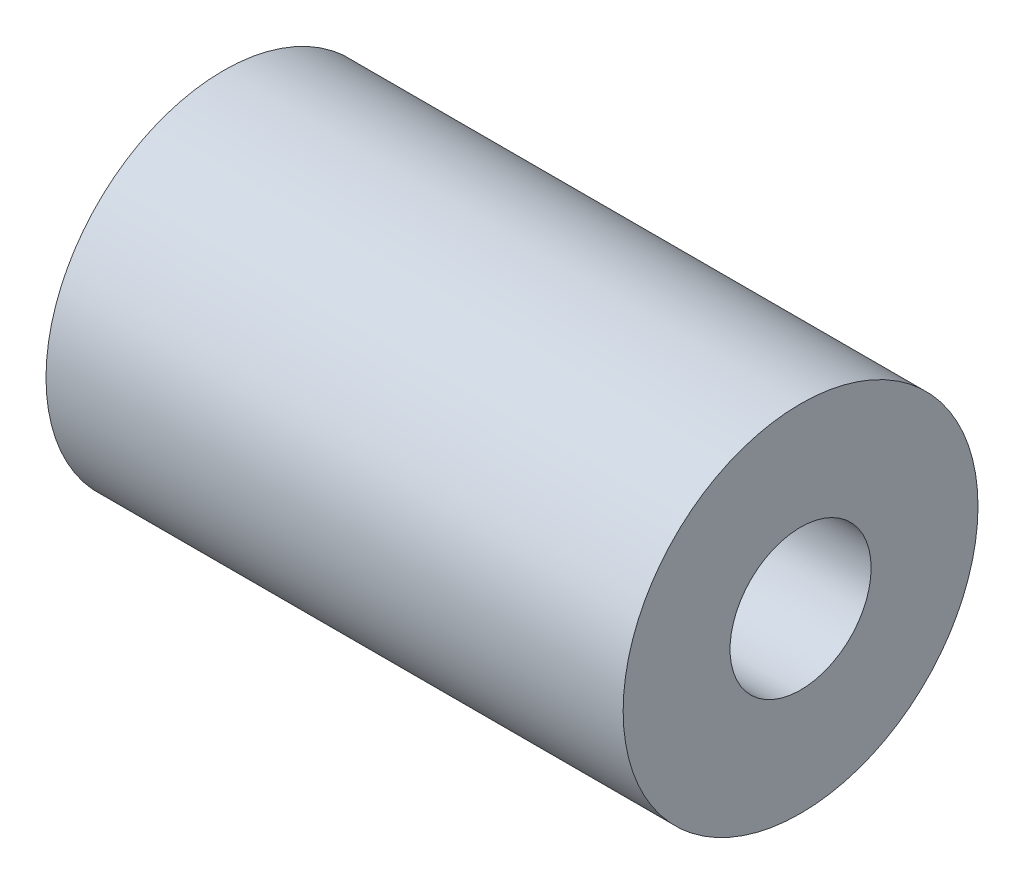
ISO-10303-21;
HEADER;
FILE_DESCRIPTION(('STEP AP214'),'2;1');
FILE_NAME('part.step','',(''),(''),'','','');
FILE_SCHEMA(('AUTOMOTIVE_DESIGN { 1 0 10303 214 1 1 1 1 }'));
ENDSEC;
DATA;
#1=APPLICATION_CONTEXT('core data for automotive mechanical design processes');
#2=APPLICATION_PROTOCOL_DEFINITION('international standard','automotive_design',2000,#1);
#3=PRODUCT_CONTEXT('',#1,'mechanical');
#4=PRODUCT('Part','Part','',(#3));
#5=PRODUCT_RELATED_PRODUCT_CATEGORY('part','',(#4));
#6=PRODUCT_DEFINITION_FORMATION('','',#4);
#7=PRODUCT_DEFINITION_CONTEXT('part definition',#1,'design');
#8=PRODUCT_DEFINITION('design','',#6,#7);
#9=PRODUCT_DEFINITION_SHAPE('','',#8);
#10=(LENGTH_UNIT() NAMED_UNIT(*) SI_UNIT(.MILLI.,.METRE.));
#11=(NAMED_UNIT(*) PLANE_ANGLE_UNIT() SI_UNIT($,.RADIAN.));
#12=(NAMED_UNIT(*) SI_UNIT($,.STERADIAN.) SOLID_ANGLE_UNIT());
#13=UNCERTAINTY_MEASURE_WITH_UNIT(LENGTH_MEASURE(1.E-05),#10,'distance_accuracy_value','');
#14=(GEOMETRIC_REPRESENTATION_CONTEXT(3) GLOBAL_UNCERTAINTY_ASSIGNED_CONTEXT((#13)) GLOBAL_UNIT_ASSIGNED_CONTEXT((#10,
#11,#12)) REPRESENTATION_CONTEXT('',''));
#15=CARTESIAN_POINT('',(0.,0.,0.));
#16=DIRECTION('',(0.,0.,1.));
#17=DIRECTION('',(1.,0.,0.));
#18=AXIS2_PLACEMENT_3D('',#15,#16,#17);
#19=CARTESIAN_POINT('',(13.5,0.,0.));
#20=DIRECTION('',(1.,0.,0.));
#21=DIRECTION('',(0.,0.,-1.));
#22=AXIS2_PLACEMENT_3D('',#19,#20,#21);
#23=PLANE('',#22);
#24=CARTESIAN_POINT('',(13.5,0.,0.));
#25=DIRECTION('',(1.,0.,0.));
#26=DIRECTION('',(0.,0.,-1.));
#27=AXIS2_PLACEMENT_3D('',#24,#25,#26);
#28=CIRCLE('',#27,4.15);
#29=CARTESIAN_POINT('',(13.5,0.,-4.15));
#30=VERTEX_POINT('',#29);
#31=EDGE_CURVE('E10',#30,#30,#28,.T.);
#32=ORIENTED_EDGE('',*,*,#31,.T.);
#33=EDGE_LOOP('',(#32));
#34=FACE_BOUND('',#33,.T.);
#35=CARTESIAN_POINT('',(13.5,0.,0.));
#36=DIRECTION('',(1.,0.,0.));
#37=DIRECTION('',(0.,0.,-1.));
#38=AXIS2_PLACEMENT_3D('',#35,#36,#37);
#39=CIRCLE('',#38,1.65);
#40=CARTESIAN_POINT('',(13.5,0.,-1.65));
#41=VERTEX_POINT('',#40);
#42=EDGE_CURVE('E43',#41,#41,#39,.T.);
#43=ORIENTED_EDGE('',*,*,#42,.F.);
#44=EDGE_LOOP('',(#43));
#45=FACE_BOUND('',#44,.T.);
#46=ADVANCED_FACE('F32',(#34,#45),#23,.T.);
#47=CARTESIAN_POINT('',(0.,0.,0.));
#48=DIRECTION('',(1.,0.,0.));
#49=DIRECTION('',(0.,0.,-1.));
#50=AXIS2_PLACEMENT_3D('',#47,#48,#49);
#51=PLANE('',#50);
#52=CARTESIAN_POINT('',(0.,0.,0.));
#53=DIRECTION('',(1.,0.,0.));
#54=DIRECTION('',(0.,0.,-1.));
#55=AXIS2_PLACEMENT_3D('',#52,#53,#54);
#56=CIRCLE('',#55,4.15);
#57=CARTESIAN_POINT('',(0.,0.,-4.15));
#58=VERTEX_POINT('',#57);
#59=EDGE_CURVE('E36',#58,#58,#56,.T.);
#60=ORIENTED_EDGE('',*,*,#59,.F.);
#61=EDGE_LOOP('',(#60));
#62=FACE_BOUND('',#61,.T.);
#63=CARTESIAN_POINT('',(0.,0.,0.));
#64=DIRECTION('',(1.,0.,0.));
#65=DIRECTION('',(0.,0.,-1.));
#66=AXIS2_PLACEMENT_3D('',#63,#64,#65);
#67=CIRCLE('',#66,1.65);
#68=CARTESIAN_POINT('',(0.,0.,-1.65));
#69=VERTEX_POINT('',#68);
#70=EDGE_CURVE('E45',#69,#69,#67,.T.);
#71=ORIENTED_EDGE('',*,*,#70,.T.);
#72=EDGE_LOOP('',(#71));
#73=FACE_BOUND('',#72,.T.);
#74=ADVANCED_FACE('F55',(#62,#73),#51,.F.);
#75=CARTESIAN_POINT('',(13.5,0.,0.));
#76=DIRECTION('',(-1.,0.,0.));
#77=DIRECTION('',(0.,0.,1.));
#78=AXIS2_PLACEMENT_3D('',#75,#76,#77);
#79=CYLINDRICAL_SURFACE('',#78,4.15);
#80=ORIENTED_EDGE('',*,*,#31,.F.);
#81=EDGE_LOOP('',(#80));
#82=FACE_BOUND('',#81,.T.);
#83=ORIENTED_EDGE('',*,*,#59,.T.);
#84=EDGE_LOOP('',(#83));
#85=FACE_BOUND('',#84,.T.);
#86=ADVANCED_FACE('F34',(#82,#85),#79,.T.);
#87=CARTESIAN_POINT('',(13.5,0.,0.));
#88=DIRECTION('',(-1.,0.,0.));
#89=DIRECTION('',(0.,0.,1.));
#90=AXIS2_PLACEMENT_3D('',#87,#88,#89);
#91=CYLINDRICAL_SURFACE('',#90,1.65);
#92=ORIENTED_EDGE('',*,*,#42,.T.);
#93=EDGE_LOOP('',(#92));
#94=FACE_BOUND('',#93,.T.);
#95=ORIENTED_EDGE('',*,*,#70,.F.);
#96=EDGE_LOOP('',(#95));
#97=FACE_BOUND('',#96,.T.);
#98=ADVANCED_FACE('F51',(#94,#97),#91,.F.);
#99=CLOSED_SHELL('',(#46,#74,#86,#98));
#100=MANIFOLD_SOLID_BREP('B2',#99);
#101=ADVANCED_BREP_SHAPE_REPRESENTATION('',(#18,#100),#14);
#102=SHAPE_DEFINITION_REPRESENTATION(#9,#101);
ENDSEC;
END-ISO-10303-21;
